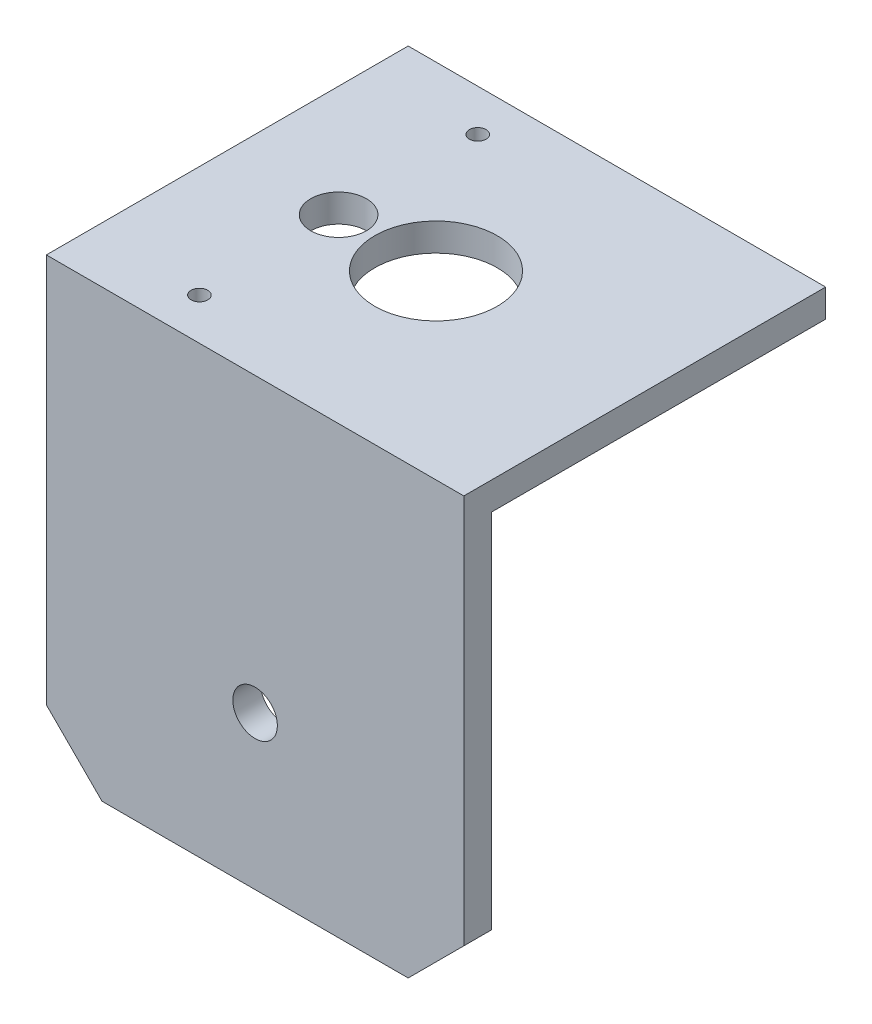
ISO-10303-21;
HEADER;
FILE_DESCRIPTION(('STEP AP214'),'2;1');
FILE_NAME('part.step','',(''),(''),'','','');
FILE_SCHEMA(('AUTOMOTIVE_DESIGN { 1 0 10303 214 1 1 1 1 }'));
ENDSEC;
DATA;
#1=APPLICATION_CONTEXT('core data for automotive mechanical design processes');
#2=APPLICATION_PROTOCOL_DEFINITION('international standard','automotive_design',2000,#1);
#3=PRODUCT_CONTEXT('',#1,'mechanical');
#4=PRODUCT('Part','Part','',(#3));
#5=PRODUCT_RELATED_PRODUCT_CATEGORY('part','',(#4));
#6=PRODUCT_DEFINITION_FORMATION('','',#4);
#7=PRODUCT_DEFINITION_CONTEXT('part definition',#1,'design');
#8=PRODUCT_DEFINITION('design','',#6,#7);
#9=PRODUCT_DEFINITION_SHAPE('','',#8);
#10=(LENGTH_UNIT() NAMED_UNIT(*) SI_UNIT(.MILLI.,.METRE.));
#11=(NAMED_UNIT(*) PLANE_ANGLE_UNIT() SI_UNIT($,.RADIAN.));
#12=(NAMED_UNIT(*) SI_UNIT($,.STERADIAN.) SOLID_ANGLE_UNIT());
#13=UNCERTAINTY_MEASURE_WITH_UNIT(LENGTH_MEASURE(1.E-05),#10,'distance_accuracy_value','');
#14=(GEOMETRIC_REPRESENTATION_CONTEXT(3) GLOBAL_UNCERTAINTY_ASSIGNED_CONTEXT((#13)) GLOBAL_UNIT_ASSIGNED_CONTEXT((#10,
#11,#12)) REPRESENTATION_CONTEXT('',''));
#15=CARTESIAN_POINT('',(0.,0.,0.));
#16=DIRECTION('',(0.,0.,1.));
#17=DIRECTION('',(1.,0.,0.));
#18=AXIS2_PLACEMENT_3D('',#15,#16,#17);
#19=CARTESIAN_POINT('',(0.,0.,0.));
#20=DIRECTION('',(0.,1.,0.));
#21=DIRECTION('',(0.,0.,1.));
#22=AXIS2_PLACEMENT_3D('',#19,#20,#21);
#23=PLANE('',#22);
#24=CARTESIAN_POINT('',(-17.5,0.,25.));
#25=DIRECTION('',(0.,1.,0.));
#26=DIRECTION('',(0.,0.,1.));
#27=AXIS2_PLACEMENT_3D('',#24,#25,#26);
#28=CIRCLE('',#27,1.5);
#29=CARTESIAN_POINT('',(-17.5,0.,26.5));
#30=VERTEX_POINT('',#29);
#31=EDGE_CURVE('E164',#30,#30,#28,.T.);
#32=ORIENTED_EDGE('',*,*,#31,.T.);
#33=EDGE_LOOP('',(#32));
#34=FACE_BOUND('',#33,.T.);
#35=CARTESIAN_POINT('',(-17.5,0.,0.));
#36=DIRECTION('',(0.,1.,0.));
#37=DIRECTION('',(0.,0.,1.));
#38=AXIS2_PLACEMENT_3D('',#35,#36,#37);
#39=CIRCLE('',#38,5.);
#40=CARTESIAN_POINT('',(-17.5,0.,5.));
#41=VERTEX_POINT('',#40);
#42=EDGE_CURVE('E138',#41,#41,#39,.T.);
#43=ORIENTED_EDGE('',*,*,#42,.T.);
#44=EDGE_LOOP('',(#43));
#45=FACE_BOUND('',#44,.T.);
#46=CARTESIAN_POINT('',(0.,0.,0.));
#47=DIRECTION('',(0.,1.,0.));
#48=DIRECTION('',(0.,0.,1.));
#49=AXIS2_PLACEMENT_3D('',#46,#47,#48);
#50=CIRCLE('',#49,11.);
#51=CARTESIAN_POINT('',(0.,0.,11.));
#52=VERTEX_POINT('',#51);
#53=EDGE_CURVE('E172',#52,#52,#50,.T.);
#54=ORIENTED_EDGE('',*,*,#53,.T.);
#55=EDGE_LOOP('',(#54));
#56=FACE_BOUND('',#55,.T.);
#57=CARTESIAN_POINT('',(-17.5,0.,-25.));
#58=DIRECTION('',(0.,1.,0.));
#59=DIRECTION('',(0.,0.,1.));
#60=AXIS2_PLACEMENT_3D('',#57,#58,#59);
#61=CIRCLE('',#60,1.5);
#62=CARTESIAN_POINT('',(-17.5,0.,-23.5));
#63=VERTEX_POINT('',#62);
#64=EDGE_CURVE('E165',#63,#63,#61,.T.);
#65=ORIENTED_EDGE('',*,*,#64,.T.);
#66=EDGE_LOOP('',(#65));
#67=FACE_BOUND('',#66,.T.);
#68=DIRECTION('',(0.,0.,1.));
#69=VECTOR('',#68,1.);
#70=CARTESIAN_POINT('',(-37.5,0.,-32.5));
#71=LINE('',#70,#69);
#72=CARTESIAN_POINT('',(-37.5,0.,-32.5));
#73=VERTEX_POINT('',#72);
#74=CARTESIAN_POINT('',(-37.5,0.,27.5));
#75=VERTEX_POINT('',#74);
#76=EDGE_CURVE('E110',#73,#75,#71,.T.);
#77=ORIENTED_EDGE('',*,*,#76,.F.);
#78=DIRECTION('',(1.,0.,0.));
#79=VECTOR('',#78,1.);
#80=CARTESIAN_POINT('',(-37.5,0.,-32.5));
#81=LINE('',#80,#79);
#82=CARTESIAN_POINT('',(37.5,0.,-32.5));
#83=VERTEX_POINT('',#82);
#84=EDGE_CURVE('E114',#73,#83,#81,.T.);
#85=ORIENTED_EDGE('',*,*,#84,.T.);
#86=DIRECTION('',(0.,0.,-1.));
#87=VECTOR('',#86,1.);
#88=CARTESIAN_POINT('',(37.5,0.,-32.5));
#89=LINE('',#88,#87);
#90=CARTESIAN_POINT('',(37.5,0.,27.5));
#91=VERTEX_POINT('',#90);
#92=EDGE_CURVE('E102',#91,#83,#89,.T.);
#93=ORIENTED_EDGE('',*,*,#92,.F.);
#94=DIRECTION('',(1.,0.,0.));
#95=VECTOR('',#94,1.);
#96=CARTESIAN_POINT('',(-37.5,0.,27.5));
#97=LINE('',#96,#95);
#98=EDGE_CURVE('E150',#75,#91,#97,.T.);
#99=ORIENTED_EDGE('',*,*,#98,.F.);
#100=EDGE_LOOP('',(#77,#85,#93,#99));
#101=FACE_BOUND('',#100,.T.);
#102=ADVANCED_FACE('F33',(#34,#45,#56,#67,#101),#23,.F.);
#103=CARTESIAN_POINT('',(0.,5.,0.));
#104=DIRECTION('',(0.,1.,0.));
#105=DIRECTION('',(0.,0.,1.));
#106=AXIS2_PLACEMENT_3D('',#103,#104,#105);
#107=PLANE('',#106);
#108=CARTESIAN_POINT('',(-17.5,5.,25.));
#109=DIRECTION('',(0.,1.,0.));
#110=DIRECTION('',(0.,0.,1.));
#111=AXIS2_PLACEMENT_3D('',#108,#109,#110);
#112=CIRCLE('',#111,1.5);
#113=CARTESIAN_POINT('',(-17.5,5.,26.5));
#114=VERTEX_POINT('',#113);
#115=EDGE_CURVE('E169',#114,#114,#112,.T.);
#116=ORIENTED_EDGE('',*,*,#115,.F.);
#117=EDGE_LOOP('',(#116));
#118=FACE_BOUND('',#117,.T.);
#119=CARTESIAN_POINT('',(-17.5,5.,0.));
#120=DIRECTION('',(0.,1.,0.));
#121=DIRECTION('',(0.,0.,1.));
#122=AXIS2_PLACEMENT_3D('',#119,#120,#121);
#123=CIRCLE('',#122,5.);
#124=CARTESIAN_POINT('',(-17.5,5.,5.));
#125=VERTEX_POINT('',#124);
#126=EDGE_CURVE('E111',#125,#125,#123,.T.);
#127=ORIENTED_EDGE('',*,*,#126,.F.);
#128=EDGE_LOOP('',(#127));
#129=FACE_BOUND('',#128,.T.);
#130=DIRECTION('',(0.,0.,-1.));
#131=VECTOR('',#130,1.);
#132=CARTESIAN_POINT('',(37.5,5.,-32.5));
#133=LINE('',#132,#131);
#134=CARTESIAN_POINT('',(37.5,5.,32.5));
#135=VERTEX_POINT('',#134);
#136=CARTESIAN_POINT('',(37.5,5.,-32.5));
#137=VERTEX_POINT('',#136);
#138=EDGE_CURVE('E127',#135,#137,#133,.T.);
#139=ORIENTED_EDGE('',*,*,#138,.T.);
#140=DIRECTION('',(-1.,0.,0.));
#141=VECTOR('',#140,1.);
#142=CARTESIAN_POINT('',(-37.5,5.,-32.5));
#143=LINE('',#142,#141);
#144=CARTESIAN_POINT('',(-37.5,5.,-32.5));
#145=VERTEX_POINT('',#144);
#146=EDGE_CURVE('E122',#137,#145,#143,.T.);
#147=ORIENTED_EDGE('',*,*,#146,.T.);
#148=DIRECTION('',(0.,0.,1.));
#149=VECTOR('',#148,1.);
#150=CARTESIAN_POINT('',(-37.5,5.,-32.5));
#151=LINE('',#150,#149);
#152=CARTESIAN_POINT('',(-37.5,5.,32.5));
#153=VERTEX_POINT('',#152);
#154=EDGE_CURVE('E126',#145,#153,#151,.T.);
#155=ORIENTED_EDGE('',*,*,#154,.T.);
#156=DIRECTION('',(1.,0.,0.));
#157=VECTOR('',#156,1.);
#158=CARTESIAN_POINT('',(-37.5,5.,32.5));
#159=LINE('',#158,#157);
#160=EDGE_CURVE('E132',#153,#135,#159,.T.);
#161=ORIENTED_EDGE('',*,*,#160,.T.);
#162=EDGE_LOOP('',(#139,#147,#155,#161));
#163=FACE_BOUND('',#162,.T.);
#164=CARTESIAN_POINT('',(0.,5.,0.));
#165=DIRECTION('',(0.,1.,0.));
#166=DIRECTION('',(0.,0.,1.));
#167=AXIS2_PLACEMENT_3D('',#164,#165,#166);
#168=CIRCLE('',#167,11.);
#169=CARTESIAN_POINT('',(0.,5.,11.));
#170=VERTEX_POINT('',#169);
#171=EDGE_CURVE('E175',#170,#170,#168,.T.);
#172=ORIENTED_EDGE('',*,*,#171,.F.);
#173=EDGE_LOOP('',(#172));
#174=FACE_BOUND('',#173,.T.);
#175=CARTESIAN_POINT('',(-17.5,5.,-25.));
#176=DIRECTION('',(0.,1.,0.));
#177=DIRECTION('',(0.,0.,1.));
#178=AXIS2_PLACEMENT_3D('',#175,#176,#177);
#179=CIRCLE('',#178,1.5);
#180=CARTESIAN_POINT('',(-17.5,5.,-23.5));
#181=VERTEX_POINT('',#180);
#182=EDGE_CURVE('E161',#181,#181,#179,.T.);
#183=ORIENTED_EDGE('',*,*,#182,.F.);
#184=EDGE_LOOP('',(#183));
#185=FACE_BOUND('',#184,.T.);
#186=ADVANCED_FACE('F129',(#118,#129,#163,#174,#185),#107,.T.);
#187=CARTESIAN_POINT('',(37.5,5.,-32.5));
#188=DIRECTION('',(-1.,0.,0.));
#189=DIRECTION('',(0.,0.,1.));
#190=AXIS2_PLACEMENT_3D('',#187,#188,#189);
#191=PLANE('',#190);
#192=ORIENTED_EDGE('',*,*,#92,.T.);
#193=DIRECTION('',(0.,-1.,0.));
#194=VECTOR('',#193,1.);
#195=CARTESIAN_POINT('',(37.5,5.,-32.5));
#196=LINE('',#195,#194);
#197=EDGE_CURVE('E11',#137,#83,#196,.T.);
#198=ORIENTED_EDGE('',*,*,#197,.F.);
#199=ORIENTED_EDGE('',*,*,#138,.F.);
#200=DIRECTION('',(0.,-1.,0.));
#201=VECTOR('',#200,1.);
#202=CARTESIAN_POINT('',(37.5,5.,32.5));
#203=LINE('',#202,#201);
#204=CARTESIAN_POINT('',(37.5,-65.,32.5));
#205=VERTEX_POINT('',#204);
#206=EDGE_CURVE('E143',#135,#205,#203,.T.);
#207=ORIENTED_EDGE('',*,*,#206,.T.);
#208=DIRECTION('',(0.,0.,1.));
#209=VECTOR('',#208,1.);
#210=CARTESIAN_POINT('',(37.5,-65.,-32.501));
#211=LINE('',#210,#209);
#212=CARTESIAN_POINT('',(37.5,-65.,27.5));
#213=VERTEX_POINT('',#212);
#214=EDGE_CURVE('E359',#213,#205,#211,.T.);
#215=ORIENTED_EDGE('',*,*,#214,.F.);
#216=DIRECTION('',(0.,1.,0.));
#217=VECTOR('',#216,1.);
#218=CARTESIAN_POINT('',(37.5,-75.,27.5));
#219=LINE('',#218,#217);
#220=EDGE_CURVE('E37',#213,#91,#219,.T.);
#221=ORIENTED_EDGE('',*,*,#220,.T.);
#222=EDGE_LOOP('',(#192,#198,#199,#207,#215,#221));
#223=FACE_BOUND('',#222,.T.);
#224=ADVANCED_FACE('F35',(#223),#191,.F.);
#225=CARTESIAN_POINT('',(-37.5,5.,-32.5));
#226=DIRECTION('',(0.,0.,1.));
#227=DIRECTION('',(1.,0.,0.));
#228=AXIS2_PLACEMENT_3D('',#225,#226,#227);
#229=PLANE('',#228);
#230=ORIENTED_EDGE('',*,*,#197,.T.);
#231=ORIENTED_EDGE('',*,*,#84,.F.);
#232=DIRECTION('',(0.,-1.,0.));
#233=VECTOR('',#232,1.);
#234=CARTESIAN_POINT('',(-37.5,5.,-32.5));
#235=LINE('',#234,#233);
#236=EDGE_CURVE('E43',#145,#73,#235,.T.);
#237=ORIENTED_EDGE('',*,*,#236,.F.);
#238=ORIENTED_EDGE('',*,*,#146,.F.);
#239=EDGE_LOOP('',(#230,#231,#237,#238));
#240=FACE_BOUND('',#239,.T.);
#241=ADVANCED_FACE('F121',(#240),#229,.F.);
#242=CARTESIAN_POINT('',(-37.5,5.,-32.5));
#243=DIRECTION('',(1.,0.,0.));
#244=DIRECTION('',(0.,0.,-1.));
#245=AXIS2_PLACEMENT_3D('',#242,#243,#244);
#246=PLANE('',#245);
#247=ORIENTED_EDGE('',*,*,#236,.T.);
#248=ORIENTED_EDGE('',*,*,#76,.T.);
#249=DIRECTION('',(0.,1.,0.));
#250=VECTOR('',#249,1.);
#251=CARTESIAN_POINT('',(-37.5,-75.,27.5));
#252=LINE('',#251,#250);
#253=CARTESIAN_POINT('',(-37.5,-65.,27.5));
#254=VERTEX_POINT('',#253);
#255=EDGE_CURVE('E168',#254,#75,#252,.T.);
#256=ORIENTED_EDGE('',*,*,#255,.F.);
#257=DIRECTION('',(0.,0.,1.));
#258=VECTOR('',#257,1.);
#259=CARTESIAN_POINT('',(-37.5,-65.,-32.501));
#260=LINE('',#259,#258);
#261=CARTESIAN_POINT('',(-37.5,-65.,32.5));
#262=VERTEX_POINT('',#261);
#263=EDGE_CURVE('E153',#254,#262,#260,.T.);
#264=ORIENTED_EDGE('',*,*,#263,.T.);
#265=DIRECTION('',(0.,-1.,0.));
#266=VECTOR('',#265,1.);
#267=CARTESIAN_POINT('',(-37.5,5.,32.5));
#268=LINE('',#267,#266);
#269=EDGE_CURVE('E376',#153,#262,#268,.T.);
#270=ORIENTED_EDGE('',*,*,#269,.F.);
#271=ORIENTED_EDGE('',*,*,#154,.F.);
#272=EDGE_LOOP('',(#247,#248,#256,#264,#270,#271));
#273=FACE_BOUND('',#272,.T.);
#274=ADVANCED_FACE('F199',(#273),#246,.F.);
#275=CARTESIAN_POINT('',(-37.5,5.,32.5));
#276=DIRECTION('',(0.,0.,-1.));
#277=DIRECTION('',(-1.,0.,0.));
#278=AXIS2_PLACEMENT_3D('',#275,#276,#277);
#279=PLANE('',#278);
#280=CARTESIAN_POINT('',(0.,-47.5,32.5));
#281=DIRECTION('',(0.,0.,1.));
#282=DIRECTION('',(1.,0.,0.));
#283=AXIS2_PLACEMENT_3D('',#280,#281,#282);
#284=CIRCLE('',#283,4.);
#285=CARTESIAN_POINT('',(4.,-47.5,32.5));
#286=VERTEX_POINT('',#285);
#287=EDGE_CURVE('E119',#286,#286,#284,.T.);
#288=ORIENTED_EDGE('',*,*,#287,.F.);
#289=EDGE_LOOP('',(#288));
#290=FACE_BOUND('',#289,.T.);
#291=DIRECTION('',(-1.,0.,0.));
#292=VECTOR('',#291,1.);
#293=CARTESIAN_POINT('',(-37.5,-75.,32.5));
#294=LINE('',#293,#292);
#295=CARTESIAN_POINT('',(27.5,-75.,32.5));
#296=VERTEX_POINT('',#295);
#297=CARTESIAN_POINT('',(-27.5,-75.,32.5));
#298=VERTEX_POINT('',#297);
#299=EDGE_CURVE('E159',#296,#298,#294,.T.);
#300=ORIENTED_EDGE('',*,*,#299,.F.);
#301=DIRECTION('',(-0.707106781186546,-0.707106781186549,0.));
#302=VECTOR('',#301,1.);
#303=CARTESIAN_POINT('',(37.5,-65.,32.5));
#304=LINE('',#303,#302);
#305=EDGE_CURVE('E51',#205,#296,#304,.T.);
#306=ORIENTED_EDGE('',*,*,#305,.F.);
#307=ORIENTED_EDGE('',*,*,#206,.F.);
#308=ORIENTED_EDGE('',*,*,#160,.F.);
#309=ORIENTED_EDGE('',*,*,#269,.T.);
#310=DIRECTION('',(-0.707106781186548,0.707106781186547,0.));
#311=VECTOR('',#310,1.);
#312=CARTESIAN_POINT('',(-27.5,-75.,32.5));
#313=LINE('',#312,#311);
#314=EDGE_CURVE('E364',#298,#262,#313,.T.);
#315=ORIENTED_EDGE('',*,*,#314,.F.);
#316=EDGE_LOOP('',(#300,#306,#307,#308,#309,#315));
#317=FACE_BOUND('',#316,.T.);
#318=ADVANCED_FACE('F190',(#290,#317),#279,.F.);
#319=CARTESIAN_POINT('',(-17.5,5.,0.));
#320=DIRECTION('',(0.,-1.,0.));
#321=DIRECTION('',(0.,0.,-1.));
#322=AXIS2_PLACEMENT_3D('',#319,#320,#321);
#323=CYLINDRICAL_SURFACE('',#322,5.);
#324=ORIENTED_EDGE('',*,*,#126,.T.);
#325=EDGE_LOOP('',(#324));
#326=FACE_BOUND('',#325,.T.);
#327=ORIENTED_EDGE('',*,*,#42,.F.);
#328=EDGE_LOOP('',(#327));
#329=FACE_BOUND('',#328,.T.);
#330=ADVANCED_FACE('F187',(#326,#329),#323,.F.);
#331=CARTESIAN_POINT('',(0.,5.,0.));
#332=DIRECTION('',(0.,-1.,0.));
#333=DIRECTION('',(0.,0.,-1.));
#334=AXIS2_PLACEMENT_3D('',#331,#332,#333);
#335=CYLINDRICAL_SURFACE('',#334,11.);
#336=ORIENTED_EDGE('',*,*,#171,.T.);
#337=EDGE_LOOP('',(#336));
#338=FACE_BOUND('',#337,.T.);
#339=ORIENTED_EDGE('',*,*,#53,.F.);
#340=EDGE_LOOP('',(#339));
#341=FACE_BOUND('',#340,.T.);
#342=ADVANCED_FACE('F189',(#338,#341),#335,.F.);
#343=CARTESIAN_POINT('',(-17.5,5.,25.));
#344=DIRECTION('',(0.,-1.,0.));
#345=DIRECTION('',(0.,0.,-1.));
#346=AXIS2_PLACEMENT_3D('',#343,#344,#345);
#347=CYLINDRICAL_SURFACE('',#346,1.5);
#348=ORIENTED_EDGE('',*,*,#115,.T.);
#349=EDGE_LOOP('',(#348));
#350=FACE_BOUND('',#349,.T.);
#351=ORIENTED_EDGE('',*,*,#31,.F.);
#352=EDGE_LOOP('',(#351));
#353=FACE_BOUND('',#352,.T.);
#354=ADVANCED_FACE('F196',(#350,#353),#347,.F.);
#355=CARTESIAN_POINT('',(-17.5,5.,-25.));
#356=DIRECTION('',(0.,-1.,0.));
#357=DIRECTION('',(0.,0.,-1.));
#358=AXIS2_PLACEMENT_3D('',#355,#356,#357);
#359=CYLINDRICAL_SURFACE('',#358,1.5);
#360=ORIENTED_EDGE('',*,*,#182,.T.);
#361=EDGE_LOOP('',(#360));
#362=FACE_BOUND('',#361,.T.);
#363=ORIENTED_EDGE('',*,*,#64,.F.);
#364=EDGE_LOOP('',(#363));
#365=FACE_BOUND('',#364,.T.);
#366=ADVANCED_FACE('F244',(#362,#365),#359,.F.);
#367=CARTESIAN_POINT('',(-37.5,-75.,27.5));
#368=DIRECTION('',(0.,0.,1.));
#369=DIRECTION('',(1.,0.,0.));
#370=AXIS2_PLACEMENT_3D('',#367,#368,#369);
#371=PLANE('',#370);
#372=CARTESIAN_POINT('',(0.,-47.5,27.5));
#373=DIRECTION('',(0.,0.,1.));
#374=DIRECTION('',(1.,0.,0.));
#375=AXIS2_PLACEMENT_3D('',#372,#373,#374);
#376=CIRCLE('',#375,4.);
#377=CARTESIAN_POINT('',(4.,-47.5,27.5));
#378=VERTEX_POINT('',#377);
#379=EDGE_CURVE('E352',#378,#378,#376,.F.);
#380=ORIENTED_EDGE('',*,*,#379,.F.);
#381=EDGE_LOOP('',(#380));
#382=FACE_BOUND('',#381,.T.);
#383=ORIENTED_EDGE('',*,*,#220,.F.);
#384=DIRECTION('',(0.707106781186546,0.707106781186549,0.));
#385=VECTOR('',#384,1.);
#386=CARTESIAN_POINT('',(37.5,-65.,27.5));
#387=LINE('',#386,#385);
#388=CARTESIAN_POINT('',(27.5,-75.,27.5));
#389=VERTEX_POINT('',#388);
#390=EDGE_CURVE('E353',#389,#213,#387,.T.);
#391=ORIENTED_EDGE('',*,*,#390,.F.);
#392=DIRECTION('',(1.,0.,0.));
#393=VECTOR('',#392,1.);
#394=CARTESIAN_POINT('',(-37.5,-75.,27.5));
#395=LINE('',#394,#393);
#396=CARTESIAN_POINT('',(-27.5,-75.,27.5));
#397=VERTEX_POINT('',#396);
#398=EDGE_CURVE('E152',#397,#389,#395,.T.);
#399=ORIENTED_EDGE('',*,*,#398,.F.);
#400=DIRECTION('',(0.707106781186548,-0.707106781186547,0.));
#401=VECTOR('',#400,1.);
#402=CARTESIAN_POINT('',(-27.5,-75.,27.5));
#403=LINE('',#402,#401);
#404=EDGE_CURVE('E59',#254,#397,#403,.T.);
#405=ORIENTED_EDGE('',*,*,#404,.F.);
#406=ORIENTED_EDGE('',*,*,#255,.T.);
#407=ORIENTED_EDGE('',*,*,#98,.T.);
#408=EDGE_LOOP('',(#383,#391,#399,#405,#406,#407));
#409=FACE_BOUND('',#408,.T.);
#410=ADVANCED_FACE('F254',(#382,#409),#371,.F.);
#411=CARTESIAN_POINT('',(0.,-75.,0.));
#412=DIRECTION('',(0.,-1.,0.));
#413=DIRECTION('',(0.,0.,-1.));
#414=AXIS2_PLACEMENT_3D('',#411,#412,#413);
#415=PLANE('',#414);
#416=DIRECTION('',(0.,0.,1.));
#417=VECTOR('',#416,1.);
#418=CARTESIAN_POINT('',(27.5,-75.,-32.501));
#419=LINE('',#418,#417);
#420=EDGE_CURVE('E360',#389,#296,#419,.T.);
#421=ORIENTED_EDGE('',*,*,#420,.T.);
#422=ORIENTED_EDGE('',*,*,#299,.T.);
#423=DIRECTION('',(0.,0.,1.));
#424=VECTOR('',#423,1.);
#425=CARTESIAN_POINT('',(-27.5,-75.,-32.501));
#426=LINE('',#425,#424);
#427=EDGE_CURVE('E366',#397,#298,#426,.T.);
#428=ORIENTED_EDGE('',*,*,#427,.F.);
#429=ORIENTED_EDGE('',*,*,#398,.T.);
#430=EDGE_LOOP('',(#421,#422,#428,#429));
#431=FACE_BOUND('',#430,.T.);
#432=ADVANCED_FACE('F262',(#431),#415,.T.);
#433=CARTESIAN_POINT('',(-27.5,-75.,-32.501));
#434=DIRECTION('',(0.707106781186547,0.707106781186548,0.));
#435=DIRECTION('',(-0.707106781186548,0.707106781186547,0.));
#436=AXIS2_PLACEMENT_3D('',#433,#434,#435);
#437=PLANE('',#436);
#438=ORIENTED_EDGE('',*,*,#404,.T.);
#439=ORIENTED_EDGE('',*,*,#427,.T.);
#440=ORIENTED_EDGE('',*,*,#314,.T.);
#441=ORIENTED_EDGE('',*,*,#263,.F.);
#442=EDGE_LOOP('',(#438,#439,#440,#441));
#443=FACE_BOUND('',#442,.T.);
#444=ADVANCED_FACE('F267',(#443),#437,.F.);
#445=CARTESIAN_POINT('',(37.5,-65.,-32.501));
#446=DIRECTION('',(-0.707106781186549,0.707106781186546,0.));
#447=DIRECTION('',(-0.707106781186546,-0.707106781186549,0.));
#448=AXIS2_PLACEMENT_3D('',#445,#446,#447);
#449=PLANE('',#448);
#450=ORIENTED_EDGE('',*,*,#390,.T.);
#451=ORIENTED_EDGE('',*,*,#214,.T.);
#452=ORIENTED_EDGE('',*,*,#305,.T.);
#453=ORIENTED_EDGE('',*,*,#420,.F.);
#454=EDGE_LOOP('',(#450,#451,#452,#453));
#455=FACE_BOUND('',#454,.T.);
#456=ADVANCED_FACE('F278',(#455),#449,.F.);
#457=CARTESIAN_POINT('',(0.,-47.5,-32.501));
#458=DIRECTION('',(0.,0.,1.));
#459=DIRECTION('',(1.,0.,0.));
#460=AXIS2_PLACEMENT_3D('',#457,#458,#459);
#461=CYLINDRICAL_SURFACE('',#460,4.);
#462=ORIENTED_EDGE('',*,*,#287,.T.);
#463=EDGE_LOOP('',(#462));
#464=FACE_BOUND('',#463,.T.);
#465=ORIENTED_EDGE('',*,*,#379,.T.);
#466=EDGE_LOOP('',(#465));
#467=FACE_BOUND('',#466,.T.);
#468=ADVANCED_FACE('F287',(#464,#467),#461,.F.);
#469=CLOSED_SHELL('',(#102,#186,#224,#241,#274,#318,#330,#342,#354,#366,#410,#432,#444,#456,#468));
#470=MANIFOLD_SOLID_BREP('B2',#469);
#471=ADVANCED_BREP_SHAPE_REPRESENTATION('',(#18,#470),#14);
#472=SHAPE_DEFINITION_REPRESENTATION(#9,#471);
ENDSEC;
END-ISO-10303-21;
